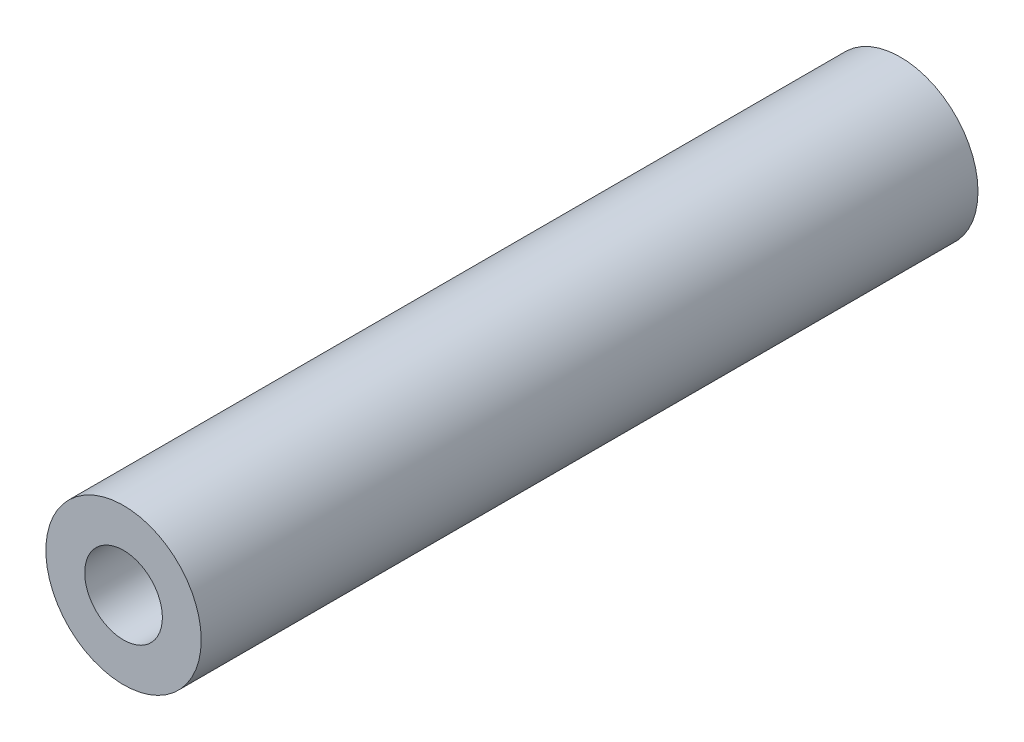
ISO-10303-21;
HEADER;
FILE_DESCRIPTION(('STEP AP214'),'2;1');
FILE_NAME('part.step','',(''),(''),'','','');
FILE_SCHEMA(('AUTOMOTIVE_DESIGN { 1 0 10303 214 1 1 1 1 }'));
ENDSEC;
DATA;
#1=APPLICATION_CONTEXT('core data for automotive mechanical design processes');
#2=APPLICATION_PROTOCOL_DEFINITION('international standard','automotive_design',2000,#1);
#3=PRODUCT_CONTEXT('',#1,'mechanical');
#4=PRODUCT('Part','Part','',(#3));
#5=PRODUCT_RELATED_PRODUCT_CATEGORY('part','',(#4));
#6=PRODUCT_DEFINITION_FORMATION('','',#4);
#7=PRODUCT_DEFINITION_CONTEXT('part definition',#1,'design');
#8=PRODUCT_DEFINITION('design','',#6,#7);
#9=PRODUCT_DEFINITION_SHAPE('','',#8);
#10=(LENGTH_UNIT() NAMED_UNIT(*) SI_UNIT(.MILLI.,.METRE.));
#11=(NAMED_UNIT(*) PLANE_ANGLE_UNIT() SI_UNIT($,.RADIAN.));
#12=(NAMED_UNIT(*) SI_UNIT($,.STERADIAN.) SOLID_ANGLE_UNIT());
#13=UNCERTAINTY_MEASURE_WITH_UNIT(LENGTH_MEASURE(1.E-05),#10,'distance_accuracy_value','');
#14=(GEOMETRIC_REPRESENTATION_CONTEXT(3) GLOBAL_UNCERTAINTY_ASSIGNED_CONTEXT((#13)) GLOBAL_UNIT_ASSIGNED_CONTEXT((#10,
#11,#12)) REPRESENTATION_CONTEXT('',''));
#15=CARTESIAN_POINT('',(0.,0.,0.));
#16=DIRECTION('',(0.,0.,1.));
#17=DIRECTION('',(1.,0.,0.));
#18=AXIS2_PLACEMENT_3D('',#15,#16,#17);
#19=CARTESIAN_POINT('',(-25.3776465904372,-4.14733597901335,16.2090770846365));
#20=DIRECTION('',(0.,0.,1.));
#21=DIRECTION('',(1.,0.,0.));
#22=AXIS2_PLACEMENT_3D('',#19,#20,#21);
#23=CYLINDRICAL_SURFACE('',#22,0.999999999999999);
#24=CARTESIAN_POINT('',(-25.3776465904372,-4.14733597901335,-3.79092291536346));
#25=DIRECTION('',(0.,0.,1.));
#26=DIRECTION('',(1.,0.,0.));
#27=AXIS2_PLACEMENT_3D('',#24,#25,#26);
#28=CIRCLE('',#27,0.999999999999999);
#29=CARTESIAN_POINT('',(-24.3776465904372,-4.14733597901335,-3.79092291536346));
#30=VERTEX_POINT('',#29);
#31=EDGE_CURVE('E37',#30,#30,#28,.F.);
#32=ORIENTED_EDGE('',*,*,#31,.T.);
#33=EDGE_LOOP('',(#32));
#34=FACE_BOUND('',#33,.T.);
#35=CARTESIAN_POINT('',(-25.3776465904372,-4.14733597901335,16.2090770846365));
#36=DIRECTION('',(0.,0.,1.));
#37=DIRECTION('',(1.,0.,0.));
#38=AXIS2_PLACEMENT_3D('',#35,#36,#37);
#39=CIRCLE('',#38,0.999999999999999);
#40=CARTESIAN_POINT('',(-24.3776465904372,-4.14733597901335,16.2090770846365));
#41=VERTEX_POINT('',#40);
#42=EDGE_CURVE('E46',#41,#41,#39,.T.);
#43=ORIENTED_EDGE('',*,*,#42,.T.);
#44=EDGE_LOOP('',(#43));
#45=FACE_BOUND('',#44,.T.);
#46=ADVANCED_FACE('F34',(#34,#45),#23,.F.);
#47=CARTESIAN_POINT('',(-25.3776465904372,-2.14733597901335,-3.79092291536346));
#48=DIRECTION('',(0.,0.,1.));
#49=DIRECTION('',(1.,0.,0.));
#50=AXIS2_PLACEMENT_3D('',#47,#48,#49);
#51=PLANE('',#50);
#52=ORIENTED_EDGE('',*,*,#31,.F.);
#53=EDGE_LOOP('',(#52));
#54=FACE_BOUND('',#53,.T.);
#55=CARTESIAN_POINT('',(-25.3776465904372,-4.14733597901335,-3.79092291536346));
#56=DIRECTION('',(0.,0.,1.));
#57=DIRECTION('',(1.,0.,0.));
#58=AXIS2_PLACEMENT_3D('',#55,#56,#57);
#59=CIRCLE('',#58,2.);
#60=CARTESIAN_POINT('',(-23.3776465904372,-4.14733597901335,-3.79092291536346));
#61=VERTEX_POINT('',#60);
#62=EDGE_CURVE('E41',#61,#61,#59,.T.);
#63=ORIENTED_EDGE('',*,*,#62,.F.);
#64=EDGE_LOOP('',(#63));
#65=FACE_BOUND('',#64,.T.);
#66=ADVANCED_FACE('F55',(#54,#65),#51,.F.);
#67=CARTESIAN_POINT('',(-25.3776465904372,-3.14733597901335,16.2090770846365));
#68=DIRECTION('',(0.,0.,-1.));
#69=DIRECTION('',(-1.,0.,0.));
#70=AXIS2_PLACEMENT_3D('',#67,#68,#69);
#71=PLANE('',#70);
#72=CARTESIAN_POINT('',(-25.3776465904372,-4.14733597901335,16.2090770846365));
#73=DIRECTION('',(0.,0.,1.));
#74=DIRECTION('',(1.,0.,0.));
#75=AXIS2_PLACEMENT_3D('',#72,#73,#74);
#76=CIRCLE('',#75,2.);
#77=CARTESIAN_POINT('',(-23.3776465904372,-4.14733597901335,16.2090770846365));
#78=VERTEX_POINT('',#77);
#79=EDGE_CURVE('E10',#78,#78,#76,.F.);
#80=ORIENTED_EDGE('',*,*,#79,.F.);
#81=EDGE_LOOP('',(#80));
#82=FACE_BOUND('',#81,.T.);
#83=ORIENTED_EDGE('',*,*,#42,.F.);
#84=EDGE_LOOP('',(#83));
#85=FACE_BOUND('',#84,.T.);
#86=ADVANCED_FACE('F58',(#82,#85),#71,.F.);
#87=CARTESIAN_POINT('',(-25.3776465904372,-4.14733597901335,16.2090770846365));
#88=DIRECTION('',(0.,0.,1.));
#89=DIRECTION('',(1.,0.,0.));
#90=AXIS2_PLACEMENT_3D('',#87,#88,#89);
#91=CYLINDRICAL_SURFACE('',#90,2.);
#92=ORIENTED_EDGE('',*,*,#79,.T.);
#93=EDGE_LOOP('',(#92));
#94=FACE_BOUND('',#93,.T.);
#95=ORIENTED_EDGE('',*,*,#62,.T.);
#96=EDGE_LOOP('',(#95));
#97=FACE_BOUND('',#96,.T.);
#98=ADVANCED_FACE('F61',(#94,#97),#91,.T.);
#99=CLOSED_SHELL('',(#46,#66,#86,#98));
#100=MANIFOLD_SOLID_BREP('B2',#99);
#101=ADVANCED_BREP_SHAPE_REPRESENTATION('',(#18,#100),#14);
#102=SHAPE_DEFINITION_REPRESENTATION(#9,#101);
ENDSEC;
END-ISO-10303-21;
